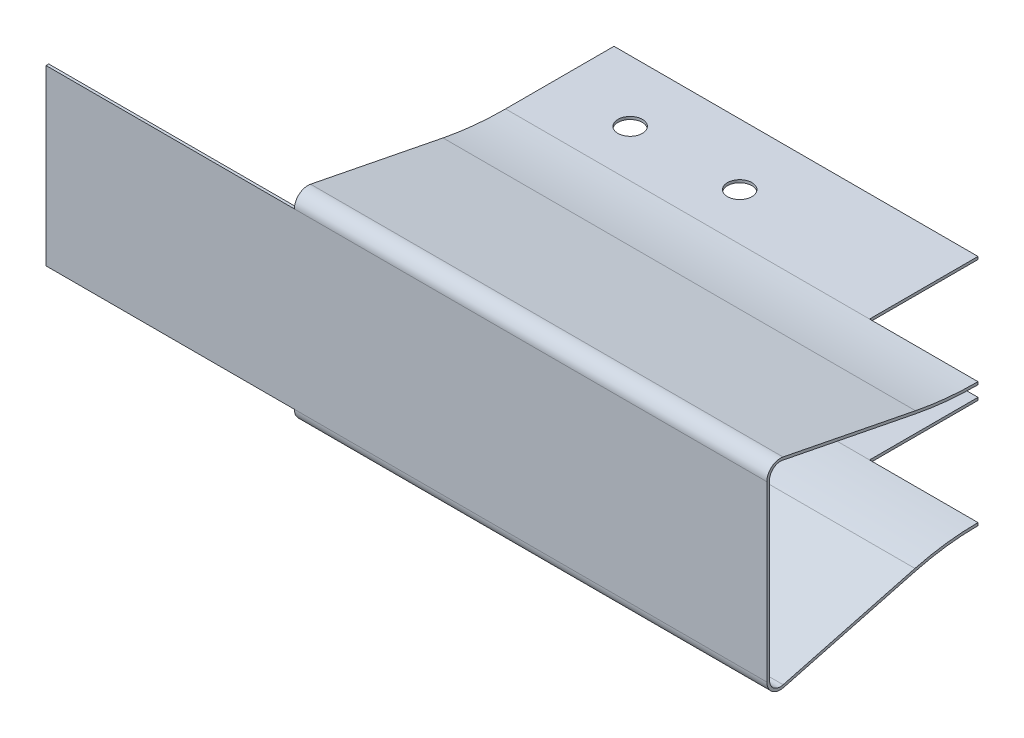
ISO-10303-21;
HEADER;
FILE_DESCRIPTION(('STEP AP214'),'2;1');
FILE_NAME('part.step','',(''),(''),'','','');
FILE_SCHEMA(('AUTOMOTIVE_DESIGN { 1 0 10303 214 1 1 1 1 }'));
ENDSEC;
DATA;
#1=APPLICATION_CONTEXT('core data for automotive mechanical design processes');
#2=APPLICATION_PROTOCOL_DEFINITION('international standard','automotive_design',2000,#1);
#3=PRODUCT_CONTEXT('',#1,'mechanical');
#4=PRODUCT('Part','Part','',(#3));
#5=PRODUCT_RELATED_PRODUCT_CATEGORY('part','',(#4));
#6=PRODUCT_DEFINITION_FORMATION('','',#4);
#7=PRODUCT_DEFINITION_CONTEXT('part definition',#1,'design');
#8=PRODUCT_DEFINITION('design','',#6,#7);
#9=PRODUCT_DEFINITION_SHAPE('','',#8);
#10=(LENGTH_UNIT() NAMED_UNIT(*) SI_UNIT(.MILLI.,.METRE.));
#11=(NAMED_UNIT(*) PLANE_ANGLE_UNIT() SI_UNIT($,.RADIAN.));
#12=(NAMED_UNIT(*) SI_UNIT($,.STERADIAN.) SOLID_ANGLE_UNIT());
#13=UNCERTAINTY_MEASURE_WITH_UNIT(LENGTH_MEASURE(1.E-05),#10,'distance_accuracy_value','');
#14=(GEOMETRIC_REPRESENTATION_CONTEXT(3) GLOBAL_UNCERTAINTY_ASSIGNED_CONTEXT((#13)) GLOBAL_UNIT_ASSIGNED_CONTEXT((#10,
#11,#12)) REPRESENTATION_CONTEXT('',''));
#15=CARTESIAN_POINT('',(0.,0.,0.));
#16=DIRECTION('',(0.,0.,1.));
#17=DIRECTION('',(1.,0.,0.));
#18=AXIS2_PLACEMENT_3D('',#15,#16,#17);
#19=CARTESIAN_POINT('',(66.46,6.56868151266737,10.8135610513));
#20=DIRECTION('',(0.,0.981043949577754,-0.193785368376667));
#21=DIRECTION('',(0.,0.193785368376667,0.981043949577755));
#22=AXIS2_PLACEMENT_3D('',#19,#20,#21);
#23=PLANE('',#22);
#24=DIRECTION('',(0.,0.193785368376667,0.981043949577755));
#25=VECTOR('',#24,1.);
#26=CARTESIAN_POINT('',(22.9,6.56868151266737,10.8135610513));
#27=LINE('',#26,#25);
#28=CARTESIAN_POINT('',(22.9,6.56868151266737,10.8135610513));
#29=VERTEX_POINT('',#28);
#30=CARTESIAN_POINT('',(22.9,8.98104394957776,23.0262146316233));
#31=VERTEX_POINT('',#30);
#32=EDGE_CURVE('E222',#29,#31,#27,.T.);
#33=ORIENTED_EDGE('',*,*,#32,.F.);
#34=DIRECTION('',(-1.,0.,0.));
#35=VECTOR('',#34,1.);
#36=CARTESIAN_POINT('',(66.46,6.56868151266737,10.8135610513));
#37=LINE('',#36,#35);
#38=CARTESIAN_POINT('',(66.46,6.56868151266737,10.8135610513));
#39=VERTEX_POINT('',#38);
#40=EDGE_CURVE('E315',#39,#29,#37,.T.);
#41=ORIENTED_EDGE('',*,*,#40,.F.);
#42=DIRECTION('',(0.,-0.193785368376667,-0.981043949577754));
#43=VECTOR('',#42,1.);
#44=CARTESIAN_POINT('',(66.46,6.56868151266737,10.8135610513));
#45=LINE('',#44,#43);
#46=CARTESIAN_POINT('',(66.46,8.98104394957776,23.0262146316233));
#47=VERTEX_POINT('',#46);
#48=EDGE_CURVE('E235',#47,#39,#45,.T.);
#49=ORIENTED_EDGE('',*,*,#48,.F.);
#50=DIRECTION('',(-1.,0.,0.));
#51=VECTOR('',#50,1.);
#52=CARTESIAN_POINT('',(66.46,8.98104394957776,23.0262146316233));
#53=LINE('',#52,#51);
#54=EDGE_CURVE('E318',#47,#31,#53,.T.);
#55=ORIENTED_EDGE('',*,*,#54,.T.);
#56=EDGE_LOOP('',(#33,#41,#49,#55));
#57=FACE_BOUND('',#56,.T.);
#58=ADVANCED_FACE('F36',(#57),#23,.F.);
#59=CARTESIAN_POINT('',(66.46,6.81394250006181,10.7651147092058));
#60=DIRECTION('',(0.,-0.981043949577754,0.193785368376668));
#61=DIRECTION('',(0.,-0.193785368376668,-0.981043949577754));
#62=AXIS2_PLACEMENT_3D('',#59,#60,#61);
#63=PLANE('',#62);
#64=DIRECTION('',(-1.,0.,0.));
#65=VECTOR('',#64,1.);
#66=CARTESIAN_POINT('',(66.46,6.81394250006181,10.7651147092058));
#67=LINE('',#66,#65);
#68=CARTESIAN_POINT('',(66.46,6.81394250006181,10.7651147092058));
#69=VERTEX_POINT('',#68);
#70=CARTESIAN_POINT('',(22.9,6.8139425000618,10.7651147092058));
#71=VERTEX_POINT('',#70);
#72=EDGE_CURVE('E301',#69,#71,#67,.T.);
#73=ORIENTED_EDGE('',*,*,#72,.T.);
#74=DIRECTION('',(0.,-0.193785368376668,-0.981043949577754));
#75=VECTOR('',#74,1.);
#76=CARTESIAN_POINT('',(22.9,6.8139425000618,10.7651147092058));
#77=LINE('',#76,#75);
#78=CARTESIAN_POINT('',(22.9,9.22630493697219,22.9777682895292));
#79=VERTEX_POINT('',#78);
#80=EDGE_CURVE('E392',#79,#71,#77,.T.);
#81=ORIENTED_EDGE('',*,*,#80,.F.);
#82=DIRECTION('',(-1.,0.,0.));
#83=VECTOR('',#82,1.);
#84=CARTESIAN_POINT('',(66.46,9.22630493697219,22.9777682895292));
#85=LINE('',#84,#83);
#86=CARTESIAN_POINT('',(66.46,9.22630493697219,22.9777682895292));
#87=VERTEX_POINT('',#86);
#88=EDGE_CURVE('E298',#87,#79,#85,.T.);
#89=ORIENTED_EDGE('',*,*,#88,.F.);
#90=DIRECTION('',(0.,0.193785368376668,0.981043949577754));
#91=VECTOR('',#90,1.);
#92=CARTESIAN_POINT('',(66.46,6.81394250006181,10.7651147092058));
#93=LINE('',#92,#91);
#94=EDGE_CURVE('E242',#69,#87,#93,.T.);
#95=ORIENTED_EDGE('',*,*,#94,.F.);
#96=EDGE_LOOP('',(#73,#81,#89,#95));
#97=FACE_BOUND('',#96,.T.);
#98=ADVANCED_FACE('F419',(#97),#63,.F.);
#99=CARTESIAN_POINT('',(66.46,-5.99699897703984,10.7496792707317));
#100=DIRECTION('',(0.,0.966801887556448,0.255527122273329));
#101=DIRECTION('',(0.,-0.25552712227333,0.966801887556448));
#102=AXIS2_PLACEMENT_3D('',#99,#100,#101);
#103=PLANE('',#102);
#104=DIRECTION('',(0.,-0.25552712227333,0.966801887556448));
#105=VECTOR('',#104,1.);
#106=CARTESIAN_POINT('',(22.9,-5.99699897703984,10.7496792707317));
#107=LINE('',#106,#105);
#108=CARTESIAN_POINT('',(22.9,-5.99699897703984,10.7496792707317));
#109=VERTEX_POINT('',#108);
#110=CARTESIAN_POINT('',(22.9,-9.20850235944556,22.9005910971583));
#111=VERTEX_POINT('',#110);
#112=EDGE_CURVE('E227',#109,#111,#107,.T.);
#113=ORIENTED_EDGE('',*,*,#112,.F.);
#114=DIRECTION('',(-1.,0.,0.));
#115=VECTOR('',#114,1.);
#116=CARTESIAN_POINT('',(66.46,-5.99699897703983,10.7496792707317));
#117=LINE('',#116,#115);
#118=CARTESIAN_POINT('',(66.46,-5.99699897703983,10.7496792707317));
#119=VERTEX_POINT('',#118);
#120=EDGE_CURVE('E288',#119,#109,#117,.T.);
#121=ORIENTED_EDGE('',*,*,#120,.F.);
#122=DIRECTION('',(0.,0.255527122273329,-0.966801887556448));
#123=VECTOR('',#122,1.);
#124=CARTESIAN_POINT('',(66.46,-5.99699897703984,10.7496792707317));
#125=LINE('',#124,#123);
#126=CARTESIAN_POINT('',(66.46,-9.20850235944556,22.9005910971583));
#127=VERTEX_POINT('',#126);
#128=EDGE_CURVE('E250',#127,#119,#125,.T.);
#129=ORIENTED_EDGE('',*,*,#128,.F.);
#130=DIRECTION('',(-1.,0.,0.));
#131=VECTOR('',#130,1.);
#132=CARTESIAN_POINT('',(66.46,-9.20850235944556,22.9005910971583));
#133=LINE('',#132,#131);
#134=EDGE_CURVE('E291',#127,#111,#133,.T.);
#135=ORIENTED_EDGE('',*,*,#134,.T.);
#136=EDGE_LOOP('',(#113,#121,#129,#135));
#137=FACE_BOUND('',#136,.T.);
#138=ADVANCED_FACE('F491',(#137),#103,.F.);
#139=CARTESIAN_POINT('',(66.46,-5.75529850515072,10.8135610513));
#140=DIRECTION('',(0.,-0.966801887556448,-0.255527122273329));
#141=DIRECTION('',(0.,0.25552712227333,-0.966801887556448));
#142=AXIS2_PLACEMENT_3D('',#139,#140,#141);
#143=PLANE('',#142);
#144=DIRECTION('',(-1.,0.,0.));
#145=VECTOR('',#144,1.);
#146=CARTESIAN_POINT('',(66.46,-5.75529850515072,10.8135610513));
#147=LINE('',#146,#145);
#148=CARTESIAN_POINT('',(66.46,-5.75529850515072,10.8135610513));
#149=VERTEX_POINT('',#148);
#150=CARTESIAN_POINT('',(22.9,-5.75529850515072,10.8135610513));
#151=VERTEX_POINT('',#150);
#152=EDGE_CURVE('E274',#149,#151,#147,.T.);
#153=ORIENTED_EDGE('',*,*,#152,.T.);
#154=DIRECTION('',(0.,0.25552712227333,-0.966801887556448));
#155=VECTOR('',#154,1.);
#156=CARTESIAN_POINT('',(22.9,-5.75529850515072,10.8135610513));
#157=LINE('',#156,#155);
#158=CARTESIAN_POINT('',(22.9,-8.96680188755645,22.9644728777267));
#159=VERTEX_POINT('',#158);
#160=EDGE_CURVE('E220',#159,#151,#157,.T.);
#161=ORIENTED_EDGE('',*,*,#160,.F.);
#162=DIRECTION('',(-1.,0.,0.));
#163=VECTOR('',#162,1.);
#164=CARTESIAN_POINT('',(66.46,-8.96680188755645,22.9644728777267));
#165=LINE('',#164,#163);
#166=CARTESIAN_POINT('',(66.46,-8.96680188755645,22.9644728777267));
#167=VERTEX_POINT('',#166);
#168=EDGE_CURVE('E271',#167,#159,#165,.T.);
#169=ORIENTED_EDGE('',*,*,#168,.F.);
#170=DIRECTION('',(0.,-0.25552712227333,0.966801887556448));
#171=VECTOR('',#170,1.);
#172=CARTESIAN_POINT('',(66.46,-5.75529850515072,10.8135610513));
#173=LINE('',#172,#171);
#174=EDGE_CURVE('E257',#149,#167,#173,.T.);
#175=ORIENTED_EDGE('',*,*,#174,.F.);
#176=EDGE_LOOP('',(#153,#161,#169,#175));
#177=FACE_BOUND('',#176,.T.);
#178=ADVANCED_FACE('F514',(#177),#143,.F.);
#179=CARTESIAN_POINT('',(66.46,36.,5.));
#180=DIRECTION('',(-1.,0.,0.));
#181=DIRECTION('',(0.,0.,1.));
#182=AXIS2_PLACEMENT_3D('',#179,#180,#181);
#183=CYLINDRICAL_SURFACE('',#182,30.);
#184=ORIENTED_EDGE('',*,*,#40,.T.);
#185=CARTESIAN_POINT('',(22.9,36.,5.));
#186=DIRECTION('',(1.,0.,0.));
#187=DIRECTION('',(0.,0.,-1.));
#188=AXIS2_PLACEMENT_3D('',#185,#186,#187);
#189=CIRCLE('',#188,30.);
#190=CARTESIAN_POINT('',(22.9,6.,5.));
#191=VERTEX_POINT('',#190);
#192=EDGE_CURVE('E353',#29,#191,#189,.T.);
#193=ORIENTED_EDGE('',*,*,#192,.T.);
#194=DIRECTION('',(-1.,0.,0.));
#195=VECTOR('',#194,1.);
#196=CARTESIAN_POINT('',(66.46,6.,5.));
#197=LINE('',#196,#195);
#198=CARTESIAN_POINT('',(56.46,6.,4.99999999999999));
#199=VERTEX_POINT('',#198);
#200=EDGE_CURVE('E312',#199,#191,#197,.T.);
#201=ORIENTED_EDGE('',*,*,#200,.F.);
#202=CARTESIAN_POINT('',(66.46,6.,4.99999999999999));
#203=VERTEX_POINT('',#202);
#204=EDGE_CURVE('E313',#203,#199,#197,.T.);
#205=ORIENTED_EDGE('',*,*,#204,.F.);
#206=CARTESIAN_POINT('',(66.46,36.,5.));
#207=DIRECTION('',(1.,0.,0.));
#208=DIRECTION('',(0.,0.,1.));
#209=AXIS2_PLACEMENT_3D('',#206,#207,#208);
#210=CIRCLE('',#209,30.);
#211=EDGE_CURVE('E237',#39,#203,#210,.T.);
#212=ORIENTED_EDGE('',*,*,#211,.F.);
#213=EDGE_LOOP('',(#184,#193,#201,#205,#212));
#214=FACE_BOUND('',#213,.T.);
#215=ADVANCED_FACE('F350',(#214),#183,.T.);
#216=CARTESIAN_POINT('',(66.46,6.,5.));
#217=DIRECTION('',(0.,1.,0.));
#218=DIRECTION('',(0.,0.,1.));
#219=AXIS2_PLACEMENT_3D('',#216,#217,#218);
#220=PLANE('',#219);
#221=CARTESIAN_POINT('',(40.14,6.,0.649999999999996));
#222=DIRECTION('',(0.,1.,0.));
#223=DIRECTION('',(0.,0.,1.));
#224=AXIS2_PLACEMENT_3D('',#221,#222,#223);
#225=CIRCLE('',#224,1.125);
#226=CARTESIAN_POINT('',(40.14,6.,1.77499999999999));
#227=VERTEX_POINT('',#226);
#228=EDGE_CURVE('E330',#227,#227,#225,.T.);
#229=ORIENTED_EDGE('',*,*,#228,.T.);
#230=EDGE_LOOP('',(#229));
#231=FACE_BOUND('',#230,.T.);
#232=CARTESIAN_POINT('',(30.04,6.,0.649999999999996));
#233=DIRECTION('',(0.,1.,0.));
#234=DIRECTION('',(0.,0.,1.));
#235=AXIS2_PLACEMENT_3D('',#232,#233,#234);
#236=CIRCLE('',#235,1.125);
#237=CARTESIAN_POINT('',(30.04,6.,1.77499999999999));
#238=VERTEX_POINT('',#237);
#239=EDGE_CURVE('E432',#238,#238,#236,.T.);
#240=ORIENTED_EDGE('',*,*,#239,.T.);
#241=EDGE_LOOP('',(#240));
#242=FACE_BOUND('',#241,.T.);
#243=DIRECTION('',(-1.,0.,0.));
#244=VECTOR('',#243,1.);
#245=CARTESIAN_POINT('',(66.46,6.,-5.));
#246=LINE('',#245,#244);
#247=CARTESIAN_POINT('',(56.46,6.,-4.99999999999999));
#248=VERTEX_POINT('',#247);
#249=CARTESIAN_POINT('',(22.9,6.,-5.));
#250=VERTEX_POINT('',#249);
#251=EDGE_CURVE('E310',#248,#250,#246,.T.);
#252=ORIENTED_EDGE('',*,*,#251,.F.);
#253=DIRECTION('',(0.,0.,1.));
#254=VECTOR('',#253,1.);
#255=CARTESIAN_POINT('',(56.46,6.,5.));
#256=LINE('',#255,#254);
#257=EDGE_CURVE('E334',#248,#199,#256,.T.);
#258=ORIENTED_EDGE('',*,*,#257,.T.);
#259=ORIENTED_EDGE('',*,*,#200,.T.);
#260=DIRECTION('',(0.,0.,-1.));
#261=VECTOR('',#260,1.);
#262=CARTESIAN_POINT('',(22.9,6.,5.));
#263=LINE('',#262,#261);
#264=EDGE_CURVE('E360',#191,#250,#263,.T.);
#265=ORIENTED_EDGE('',*,*,#264,.T.);
#266=EDGE_LOOP('',(#252,#258,#259,#265));
#267=FACE_BOUND('',#266,.T.);
#268=ADVANCED_FACE('F359',(#231,#242,#267),#220,.F.);
#269=CARTESIAN_POINT('',(66.46,6.25,-5.));
#270=DIRECTION('',(0.,0.,1.));
#271=DIRECTION('',(1.,0.,0.));
#272=AXIS2_PLACEMENT_3D('',#269,#270,#271);
#273=PLANE('',#272);
#274=DIRECTION('',(-1.,0.,0.));
#275=VECTOR('',#274,1.);
#276=CARTESIAN_POINT('',(66.46,6.25,-5.));
#277=LINE('',#276,#275);
#278=CARTESIAN_POINT('',(56.46,6.25,-4.99999999999999));
#279=VERTEX_POINT('',#278);
#280=CARTESIAN_POINT('',(22.9,6.25,-5.));
#281=VERTEX_POINT('',#280);
#282=EDGE_CURVE('E308',#279,#281,#277,.T.);
#283=ORIENTED_EDGE('',*,*,#282,.F.);
#284=DIRECTION('',(0.,1.,0.));
#285=VECTOR('',#284,1.);
#286=CARTESIAN_POINT('',(56.46,-9.25,-4.99999999999999));
#287=LINE('',#286,#285);
#288=EDGE_CURVE('E202',#248,#279,#287,.T.);
#289=ORIENTED_EDGE('',*,*,#288,.F.);
#290=ORIENTED_EDGE('',*,*,#251,.T.);
#291=DIRECTION('',(0.,1.,0.));
#292=VECTOR('',#291,1.);
#293=CARTESIAN_POINT('',(22.9,-9.25,-5.));
#294=LINE('',#293,#292);
#295=EDGE_CURVE('E366',#250,#281,#294,.T.);
#296=ORIENTED_EDGE('',*,*,#295,.T.);
#297=EDGE_LOOP('',(#283,#289,#290,#296));
#298=FACE_BOUND('',#297,.T.);
#299=ADVANCED_FACE('F430',(#298),#273,.F.);
#300=CARTESIAN_POINT('',(66.46,6.25,5.));
#301=DIRECTION('',(0.,-1.,0.));
#302=DIRECTION('',(0.,0.,-1.));
#303=AXIS2_PLACEMENT_3D('',#300,#301,#302);
#304=PLANE('',#303);
#305=CARTESIAN_POINT('',(40.14,6.25,0.649999999999996));
#306=DIRECTION('',(0.,-1.,0.));
#307=DIRECTION('',(0.,0.,-1.));
#308=AXIS2_PLACEMENT_3D('',#305,#306,#307);
#309=CIRCLE('',#308,1.125);
#310=CARTESIAN_POINT('',(40.14,6.25,-0.475000000000001));
#311=VERTEX_POINT('',#310);
#312=EDGE_CURVE('E444',#311,#311,#309,.T.);
#313=ORIENTED_EDGE('',*,*,#312,.T.);
#314=EDGE_LOOP('',(#313));
#315=FACE_BOUND('',#314,.T.);
#316=CARTESIAN_POINT('',(30.04,6.25,0.649999999999996));
#317=DIRECTION('',(0.,-1.,0.));
#318=DIRECTION('',(0.,0.,-1.));
#319=AXIS2_PLACEMENT_3D('',#316,#317,#318);
#320=CIRCLE('',#319,1.125);
#321=CARTESIAN_POINT('',(30.04,6.25,-0.475000000000001));
#322=VERTEX_POINT('',#321);
#323=EDGE_CURVE('E435',#322,#322,#320,.T.);
#324=ORIENTED_EDGE('',*,*,#323,.T.);
#325=EDGE_LOOP('',(#324));
#326=FACE_BOUND('',#325,.T.);
#327=DIRECTION('',(-1.,0.,0.));
#328=VECTOR('',#327,1.);
#329=CARTESIAN_POINT('',(66.46,6.25,4.99999999999999));
#330=LINE('',#329,#328);
#331=CARTESIAN_POINT('',(56.46,6.25,4.99999999999999));
#332=VERTEX_POINT('',#331);
#333=CARTESIAN_POINT('',(22.9,6.25,4.99999999999999));
#334=VERTEX_POINT('',#333);
#335=EDGE_CURVE('E304',#332,#334,#330,.T.);
#336=ORIENTED_EDGE('',*,*,#335,.F.);
#337=DIRECTION('',(0.,0.,-1.));
#338=VECTOR('',#337,1.);
#339=CARTESIAN_POINT('',(56.46,6.25,5.));
#340=LINE('',#339,#338);
#341=EDGE_CURVE('E427',#332,#279,#340,.T.);
#342=ORIENTED_EDGE('',*,*,#341,.T.);
#343=ORIENTED_EDGE('',*,*,#282,.T.);
#344=DIRECTION('',(0.,0.,1.));
#345=VECTOR('',#344,1.);
#346=CARTESIAN_POINT('',(22.9,6.25,5.));
#347=LINE('',#346,#345);
#348=EDGE_CURVE('E387',#281,#334,#347,.T.);
#349=ORIENTED_EDGE('',*,*,#348,.T.);
#350=EDGE_LOOP('',(#336,#342,#343,#349));
#351=FACE_BOUND('',#350,.T.);
#352=ADVANCED_FACE('F426',(#315,#326,#351),#304,.F.);
#353=CARTESIAN_POINT('',(66.46,36.,5.));
#354=DIRECTION('',(-1.,0.,0.));
#355=DIRECTION('',(0.,0.,1.));
#356=AXIS2_PLACEMENT_3D('',#353,#354,#355);
#357=CYLINDRICAL_SURFACE('',#356,29.75);
#358=CARTESIAN_POINT('',(66.46,6.25,4.99999999999999));
#359=VERTEX_POINT('',#358);
#360=EDGE_CURVE('E305',#359,#332,#330,.T.);
#361=ORIENTED_EDGE('',*,*,#360,.T.);
#362=ORIENTED_EDGE('',*,*,#335,.T.);
#363=CARTESIAN_POINT('',(22.9,36.,5.));
#364=DIRECTION('',(1.,0.,0.));
#365=DIRECTION('',(0.,0.,-1.));
#366=AXIS2_PLACEMENT_3D('',#363,#364,#365);
#367=CIRCLE('',#366,29.75);
#368=EDGE_CURVE('E384',#334,#71,#367,.F.);
#369=ORIENTED_EDGE('',*,*,#368,.T.);
#370=ORIENTED_EDGE('',*,*,#72,.F.);
#371=CARTESIAN_POINT('',(66.46,36.,5.));
#372=DIRECTION('',(-1.,0.,0.));
#373=DIRECTION('',(0.,0.,1.));
#374=AXIS2_PLACEMENT_3D('',#371,#372,#373);
#375=CIRCLE('',#374,29.75);
#376=EDGE_CURVE('E240',#359,#69,#375,.T.);
#377=ORIENTED_EDGE('',*,*,#376,.F.);
#378=EDGE_LOOP('',(#361,#362,#369,#370,#377));
#379=FACE_BOUND('',#378,.T.);
#380=ADVANCED_FACE('F422',(#379),#357,.F.);
#381=CARTESIAN_POINT('',(66.46,-27.7512484764001,5.));
#382=DIRECTION('',(-1.,0.,0.));
#383=DIRECTION('',(0.,0.,1.));
#384=AXIS2_PLACEMENT_3D('',#381,#382,#383);
#385=CYLINDRICAL_SURFACE('',#384,22.5012484764001);
#386=ORIENTED_EDGE('',*,*,#120,.T.);
#387=CARTESIAN_POINT('',(22.9,-27.7512484764001,5.));
#388=DIRECTION('',(1.,0.,0.));
#389=DIRECTION('',(0.,0.,-1.));
#390=AXIS2_PLACEMENT_3D('',#387,#388,#389);
#391=CIRCLE('',#390,22.5012484764001);
#392=CARTESIAN_POINT('',(22.9,-5.25,5.));
#393=VERTEX_POINT('',#392);
#394=EDGE_CURVE('E367',#109,#393,#391,.F.);
#395=ORIENTED_EDGE('',*,*,#394,.T.);
#396=DIRECTION('',(-1.,0.,0.));
#397=VECTOR('',#396,1.);
#398=CARTESIAN_POINT('',(66.46,-5.25,5.));
#399=LINE('',#398,#397);
#400=CARTESIAN_POINT('',(56.46,-5.25,4.99999999999999));
#401=VERTEX_POINT('',#400);
#402=EDGE_CURVE('E285',#401,#393,#399,.T.);
#403=ORIENTED_EDGE('',*,*,#402,.F.);
#404=CARTESIAN_POINT('',(66.46,-5.25,4.99999999999999));
#405=VERTEX_POINT('',#404);
#406=EDGE_CURVE('E286',#405,#401,#399,.T.);
#407=ORIENTED_EDGE('',*,*,#406,.F.);
#408=CARTESIAN_POINT('',(66.46,-27.7512484764001,5.));
#409=DIRECTION('',(-1.,0.,0.));
#410=DIRECTION('',(0.,0.,-1.));
#411=AXIS2_PLACEMENT_3D('',#408,#409,#410);
#412=CIRCLE('',#411,22.5012484764001);
#413=EDGE_CURVE('E252',#119,#405,#412,.T.);
#414=ORIENTED_EDGE('',*,*,#413,.F.);
#415=EDGE_LOOP('',(#386,#395,#403,#407,#414));
#416=FACE_BOUND('',#415,.T.);
#417=ADVANCED_FACE('F486',(#416),#385,.F.);
#418=CARTESIAN_POINT('',(66.46,-5.25,5.));
#419=DIRECTION('',(0.,1.,0.));
#420=DIRECTION('',(0.,0.,1.));
#421=AXIS2_PLACEMENT_3D('',#418,#419,#420);
#422=PLANE('',#421);
#423=CARTESIAN_POINT('',(40.14,-5.25,0.649999999999996));
#424=DIRECTION('',(0.,1.,0.));
#425=DIRECTION('',(0.,0.,1.));
#426=AXIS2_PLACEMENT_3D('',#423,#424,#425);
#427=CIRCLE('',#426,1.125);
#428=CARTESIAN_POINT('',(40.14,-5.25,1.77499999999999));
#429=VERTEX_POINT('',#428);
#430=EDGE_CURVE('E333',#429,#429,#427,.T.);
#431=ORIENTED_EDGE('',*,*,#430,.T.);
#432=EDGE_LOOP('',(#431));
#433=FACE_BOUND('',#432,.T.);
#434=CARTESIAN_POINT('',(30.04,-5.25,0.649999999999996));
#435=DIRECTION('',(0.,1.,0.));
#436=DIRECTION('',(0.,0.,1.));
#437=AXIS2_PLACEMENT_3D('',#434,#435,#436);
#438=CIRCLE('',#437,1.125);
#439=CARTESIAN_POINT('',(30.04,-5.25,1.77499999999999));
#440=VERTEX_POINT('',#439);
#441=EDGE_CURVE('E329',#440,#440,#438,.T.);
#442=ORIENTED_EDGE('',*,*,#441,.T.);
#443=EDGE_LOOP('',(#442));
#444=FACE_BOUND('',#443,.T.);
#445=DIRECTION('',(-1.,0.,0.));
#446=VECTOR('',#445,1.);
#447=CARTESIAN_POINT('',(66.46,-5.25,-5.));
#448=LINE('',#447,#446);
#449=CARTESIAN_POINT('',(56.46,-5.25,-4.99999999999999));
#450=VERTEX_POINT('',#449);
#451=CARTESIAN_POINT('',(22.9,-5.25,-5.));
#452=VERTEX_POINT('',#451);
#453=EDGE_CURVE('E283',#450,#452,#448,.T.);
#454=ORIENTED_EDGE('',*,*,#453,.F.);
#455=DIRECTION('',(0.,0.,1.));
#456=VECTOR('',#455,1.);
#457=CARTESIAN_POINT('',(56.46,-5.25,5.));
#458=LINE('',#457,#456);
#459=EDGE_CURVE('E451',#450,#401,#458,.T.);
#460=ORIENTED_EDGE('',*,*,#459,.T.);
#461=ORIENTED_EDGE('',*,*,#402,.T.);
#462=DIRECTION('',(0.,0.,-1.));
#463=VECTOR('',#462,1.);
#464=CARTESIAN_POINT('',(22.9,-5.25,5.));
#465=LINE('',#464,#463);
#466=EDGE_CURVE('E370',#393,#452,#465,.T.);
#467=ORIENTED_EDGE('',*,*,#466,.T.);
#468=EDGE_LOOP('',(#454,#460,#461,#467));
#469=FACE_BOUND('',#468,.T.);
#470=ADVANCED_FACE('F482',(#433,#444,#469),#422,.F.);
#471=CARTESIAN_POINT('',(66.46,-5.,-5.));
#472=DIRECTION('',(0.,0.,1.));
#473=DIRECTION('',(1.,0.,0.));
#474=AXIS2_PLACEMENT_3D('',#471,#472,#473);
#475=PLANE('',#474);
#476=DIRECTION('',(-1.,0.,0.));
#477=VECTOR('',#476,1.);
#478=CARTESIAN_POINT('',(66.46,-5.,-5.));
#479=LINE('',#478,#477);
#480=CARTESIAN_POINT('',(56.46,-5.,-4.99999999999999));
#481=VERTEX_POINT('',#480);
#482=CARTESIAN_POINT('',(22.9,-5.,-5.));
#483=VERTEX_POINT('',#482);
#484=EDGE_CURVE('E281',#481,#483,#479,.T.);
#485=ORIENTED_EDGE('',*,*,#484,.F.);
#486=EDGE_CURVE('E459',#450,#481,#287,.T.);
#487=ORIENTED_EDGE('',*,*,#486,.F.);
#488=ORIENTED_EDGE('',*,*,#453,.T.);
#489=EDGE_CURVE('E372',#452,#483,#294,.T.);
#490=ORIENTED_EDGE('',*,*,#489,.T.);
#491=EDGE_LOOP('',(#485,#487,#488,#490));
#492=FACE_BOUND('',#491,.T.);
#493=ADVANCED_FACE('F474',(#492),#475,.F.);
#494=CARTESIAN_POINT('',(66.46,-5.,5.));
#495=DIRECTION('',(0.,-1.,0.));
#496=DIRECTION('',(0.,0.,-1.));
#497=AXIS2_PLACEMENT_3D('',#494,#495,#496);
#498=PLANE('',#497);
#499=CARTESIAN_POINT('',(40.14,-5.,0.649999999999996));
#500=DIRECTION('',(0.,-1.,0.));
#501=DIRECTION('',(0.,0.,-1.));
#502=AXIS2_PLACEMENT_3D('',#499,#500,#501);
#503=CIRCLE('',#502,1.125);
#504=CARTESIAN_POINT('',(40.14,-5.,-0.475000000000001));
#505=VERTEX_POINT('',#504);
#506=EDGE_CURVE('E331',#505,#505,#503,.T.);
#507=ORIENTED_EDGE('',*,*,#506,.T.);
#508=EDGE_LOOP('',(#507));
#509=FACE_BOUND('',#508,.T.);
#510=CARTESIAN_POINT('',(30.04,-5.,0.649999999999996));
#511=DIRECTION('',(0.,-1.,0.));
#512=DIRECTION('',(0.,0.,-1.));
#513=AXIS2_PLACEMENT_3D('',#510,#511,#512);
#514=CIRCLE('',#513,1.125);
#515=CARTESIAN_POINT('',(30.04,-5.,-0.475000000000001));
#516=VERTEX_POINT('',#515);
#517=EDGE_CURVE('E326',#516,#516,#514,.T.);
#518=ORIENTED_EDGE('',*,*,#517,.T.);
#519=EDGE_LOOP('',(#518));
#520=FACE_BOUND('',#519,.T.);
#521=DIRECTION('',(-1.,0.,0.));
#522=VECTOR('',#521,1.);
#523=CARTESIAN_POINT('',(66.46,-5.,5.));
#524=LINE('',#523,#522);
#525=CARTESIAN_POINT('',(56.46,-5.,4.99999999999999));
#526=VERTEX_POINT('',#525);
#527=CARTESIAN_POINT('',(22.9,-5.,5.));
#528=VERTEX_POINT('',#527);
#529=EDGE_CURVE('E277',#526,#528,#524,.T.);
#530=ORIENTED_EDGE('',*,*,#529,.F.);
#531=DIRECTION('',(0.,0.,-1.));
#532=VECTOR('',#531,1.);
#533=CARTESIAN_POINT('',(56.46,-5.,5.));
#534=LINE('',#533,#532);
#535=EDGE_CURVE('E454',#526,#481,#534,.T.);
#536=ORIENTED_EDGE('',*,*,#535,.T.);
#537=ORIENTED_EDGE('',*,*,#484,.T.);
#538=DIRECTION('',(0.,0.,1.));
#539=VECTOR('',#538,1.);
#540=CARTESIAN_POINT('',(22.9,-5.,5.));
#541=LINE('',#540,#539);
#542=EDGE_CURVE('E381',#483,#528,#541,.T.);
#543=ORIENTED_EDGE('',*,*,#542,.T.);
#544=EDGE_LOOP('',(#530,#536,#537,#543));
#545=FACE_BOUND('',#544,.T.);
#546=ADVANCED_FACE('F472',(#509,#520,#545),#498,.F.);
#547=CARTESIAN_POINT('',(66.46,-27.7512484764001,5.));
#548=DIRECTION('',(-1.,0.,0.));
#549=DIRECTION('',(0.,0.,1.));
#550=AXIS2_PLACEMENT_3D('',#547,#548,#549);
#551=CYLINDRICAL_SURFACE('',#550,22.7512484764001);
#552=CARTESIAN_POINT('',(66.46,-5.,5.));
#553=VERTEX_POINT('',#552);
#554=EDGE_CURVE('E278',#553,#526,#524,.T.);
#555=ORIENTED_EDGE('',*,*,#554,.T.);
#556=ORIENTED_EDGE('',*,*,#529,.T.);
#557=CARTESIAN_POINT('',(22.9,-27.7512484764001,5.));
#558=DIRECTION('',(1.,0.,0.));
#559=DIRECTION('',(0.,0.,-1.));
#560=AXIS2_PLACEMENT_3D('',#557,#558,#559);
#561=CIRCLE('',#560,22.7512484764001);
#562=EDGE_CURVE('E378',#528,#151,#561,.T.);
#563=ORIENTED_EDGE('',*,*,#562,.T.);
#564=ORIENTED_EDGE('',*,*,#152,.F.);
#565=CARTESIAN_POINT('',(66.46,-27.7512484764001,5.));
#566=DIRECTION('',(1.,0.,0.));
#567=DIRECTION('',(0.,0.,-1.));
#568=AXIS2_PLACEMENT_3D('',#565,#566,#567);
#569=CIRCLE('',#568,22.7512484764001);
#570=EDGE_CURVE('E255',#553,#149,#569,.T.);
#571=ORIENTED_EDGE('',*,*,#570,.F.);
#572=EDGE_LOOP('',(#555,#556,#563,#564,#571));
#573=FACE_BOUND('',#572,.T.);
#574=ADVANCED_FACE('F538',(#573),#551,.T.);
#575=CARTESIAN_POINT('',(66.46,8.,23.22));
#576=DIRECTION('',(-1.,0.,0.));
#577=DIRECTION('',(0.,0.,1.));
#578=AXIS2_PLACEMENT_3D('',#575,#576,#577);
#579=CYLINDRICAL_SURFACE('',#578,1.);
#580=CARTESIAN_POINT('',(22.9,8.,23.22));
#581=DIRECTION('',(-1.,0.,0.));
#582=DIRECTION('',(0.,-1.,0.));
#583=AXIS2_PLACEMENT_3D('',#580,#581,#582);
#584=CIRCLE('',#583,1.);
#585=CARTESIAN_POINT('',(22.9,8.,24.22));
#586=VERTEX_POINT('',#585);
#587=EDGE_CURVE('E218',#31,#586,#584,.F.);
#588=ORIENTED_EDGE('',*,*,#587,.F.);
#589=ORIENTED_EDGE('',*,*,#54,.F.);
#590=CARTESIAN_POINT('',(66.46,8.,23.22));
#591=DIRECTION('',(-1.,0.,0.));
#592=DIRECTION('',(0.,0.,-1.));
#593=AXIS2_PLACEMENT_3D('',#590,#591,#592);
#594=CIRCLE('',#593,1.);
#595=CARTESIAN_POINT('',(66.46,8.,24.22));
#596=VERTEX_POINT('',#595);
#597=EDGE_CURVE('E232',#596,#47,#594,.T.);
#598=ORIENTED_EDGE('',*,*,#597,.F.);
#599=DIRECTION('',(-1.,0.,0.));
#600=VECTOR('',#599,1.);
#601=CARTESIAN_POINT('',(66.46,8.,24.22));
#602=LINE('',#601,#600);
#603=EDGE_CURVE('E264',#596,#586,#602,.T.);
#604=ORIENTED_EDGE('',*,*,#603,.T.);
#605=EDGE_LOOP('',(#588,#589,#598,#604));
#606=FACE_BOUND('',#605,.T.);
#607=ADVANCED_FACE('F38',(#606),#579,.F.);
#608=CARTESIAN_POINT('',(66.46,8.,23.22));
#609=DIRECTION('',(-1.,0.,0.));
#610=DIRECTION('',(0.,0.,1.));
#611=AXIS2_PLACEMENT_3D('',#608,#609,#610);
#612=CYLINDRICAL_SURFACE('',#611,1.25);
#613=CARTESIAN_POINT('',(22.9,8.,23.22));
#614=DIRECTION('',(-1.,0.,0.));
#615=DIRECTION('',(0.,-1.,0.));
#616=AXIS2_PLACEMENT_3D('',#613,#614,#615);
#617=CIRCLE('',#616,1.25);
#618=CARTESIAN_POINT('',(22.9,8.,24.47));
#619=VERTEX_POINT('',#618);
#620=EDGE_CURVE('E323',#619,#79,#617,.T.);
#621=ORIENTED_EDGE('',*,*,#620,.F.);
#622=DIRECTION('',(-1.,0.,0.));
#623=VECTOR('',#622,1.);
#624=CARTESIAN_POINT('',(66.46,8.,24.47));
#625=LINE('',#624,#623);
#626=CARTESIAN_POINT('',(66.46,8.,24.47));
#627=VERTEX_POINT('',#626);
#628=EDGE_CURVE('E296',#627,#619,#625,.T.);
#629=ORIENTED_EDGE('',*,*,#628,.F.);
#630=CARTESIAN_POINT('',(66.46,8.,23.22));
#631=DIRECTION('',(1.,0.,0.));
#632=DIRECTION('',(0.,0.,-1.));
#633=AXIS2_PLACEMENT_3D('',#630,#631,#632);
#634=CIRCLE('',#633,1.25);
#635=EDGE_CURVE('E244',#87,#627,#634,.T.);
#636=ORIENTED_EDGE('',*,*,#635,.F.);
#637=ORIENTED_EDGE('',*,*,#88,.T.);
#638=EDGE_LOOP('',(#621,#629,#636,#637));
#639=FACE_BOUND('',#638,.T.);
#640=ADVANCED_FACE('F409',(#639),#612,.T.);
#641=CARTESIAN_POINT('',(66.46,-8.,23.22));
#642=DIRECTION('',(-1.,0.,0.));
#643=DIRECTION('',(0.,0.,1.));
#644=AXIS2_PLACEMENT_3D('',#641,#642,#643);
#645=CYLINDRICAL_SURFACE('',#644,1.25);
#646=CARTESIAN_POINT('',(22.9,-8.,23.22));
#647=DIRECTION('',(-1.,0.,0.));
#648=DIRECTION('',(0.,0.,1.));
#649=AXIS2_PLACEMENT_3D('',#646,#647,#648);
#650=CIRCLE('',#649,1.25);
#651=CARTESIAN_POINT('',(22.9,-8.,24.47));
#652=VERTEX_POINT('',#651);
#653=EDGE_CURVE('E230',#111,#652,#650,.T.);
#654=ORIENTED_EDGE('',*,*,#653,.F.);
#655=ORIENTED_EDGE('',*,*,#134,.F.);
#656=CARTESIAN_POINT('',(66.46,-8.,23.22));
#657=DIRECTION('',(1.,0.,0.));
#658=DIRECTION('',(0.,0.,-1.));
#659=AXIS2_PLACEMENT_3D('',#656,#657,#658);
#660=CIRCLE('',#659,1.25);
#661=CARTESIAN_POINT('',(66.46,-8.,24.47));
#662=VERTEX_POINT('',#661);
#663=EDGE_CURVE('E248',#662,#127,#660,.T.);
#664=ORIENTED_EDGE('',*,*,#663,.F.);
#665=DIRECTION('',(-1.,0.,0.));
#666=VECTOR('',#665,1.);
#667=CARTESIAN_POINT('',(66.46,-8.,24.47));
#668=LINE('',#667,#666);
#669=EDGE_CURVE('E294',#662,#652,#668,.T.);
#670=ORIENTED_EDGE('',*,*,#669,.T.);
#671=EDGE_LOOP('',(#654,#655,#664,#670));
#672=FACE_BOUND('',#671,.T.);
#673=ADVANCED_FACE('F493',(#672),#645,.T.);
#674=CARTESIAN_POINT('',(66.46,-8.,23.22));
#675=DIRECTION('',(-1.,0.,0.));
#676=DIRECTION('',(0.,0.,1.));
#677=AXIS2_PLACEMENT_3D('',#674,#675,#676);
#678=CYLINDRICAL_SURFACE('',#677,1.);
#679=CARTESIAN_POINT('',(22.9,-8.,23.22));
#680=DIRECTION('',(-1.,0.,0.));
#681=DIRECTION('',(0.,0.,1.));
#682=AXIS2_PLACEMENT_3D('',#679,#680,#681);
#683=CIRCLE('',#682,1.);
#684=CARTESIAN_POINT('',(22.9,-8.,24.22));
#685=VERTEX_POINT('',#684);
#686=EDGE_CURVE('E321',#685,#159,#683,.F.);
#687=ORIENTED_EDGE('',*,*,#686,.F.);
#688=DIRECTION('',(-1.,0.,0.));
#689=VECTOR('',#688,1.);
#690=CARTESIAN_POINT('',(66.46,-8.,24.22));
#691=LINE('',#690,#689);
#692=CARTESIAN_POINT('',(66.46,-8.,24.22));
#693=VERTEX_POINT('',#692);
#694=EDGE_CURVE('E268',#693,#685,#691,.T.);
#695=ORIENTED_EDGE('',*,*,#694,.F.);
#696=CARTESIAN_POINT('',(66.46,-8.,23.22));
#697=DIRECTION('',(-1.,0.,0.));
#698=DIRECTION('',(0.,0.,-1.));
#699=AXIS2_PLACEMENT_3D('',#696,#697,#698);
#700=CIRCLE('',#699,1.);
#701=EDGE_CURVE('E259',#167,#693,#700,.T.);
#702=ORIENTED_EDGE('',*,*,#701,.F.);
#703=ORIENTED_EDGE('',*,*,#168,.T.);
#704=EDGE_LOOP('',(#687,#695,#702,#703));
#705=FACE_BOUND('',#704,.T.);
#706=ADVANCED_FACE('F495',(#705),#678,.F.);
#707=CARTESIAN_POINT('',(66.46,8.,24.47));
#708=DIRECTION('',(0.,0.,-1.));
#709=DIRECTION('',(-1.,0.,0.));
#710=AXIS2_PLACEMENT_3D('',#707,#708,#709);
#711=PLANE('',#710);
#712=DIRECTION('',(1.,0.,0.));
#713=VECTOR('',#712,1.);
#714=CARTESIAN_POINT('',(-22.9,8.,24.47));
#715=LINE('',#714,#713);
#716=CARTESIAN_POINT('',(0.,8.,24.47));
#717=VERTEX_POINT('',#716);
#718=EDGE_CURVE('E212',#717,#619,#715,.T.);
#719=ORIENTED_EDGE('',*,*,#718,.F.);
#720=DIRECTION('',(0.,1.,0.));
#721=VECTOR('',#720,1.);
#722=CARTESIAN_POINT('',(0.,-9.25,24.47));
#723=LINE('',#722,#721);
#724=CARTESIAN_POINT('',(0.,-8.,24.47));
#725=VERTEX_POINT('',#724);
#726=EDGE_CURVE('E50',#725,#717,#723,.T.);
#727=ORIENTED_EDGE('',*,*,#726,.F.);
#728=DIRECTION('',(-1.,0.,0.));
#729=VECTOR('',#728,1.);
#730=CARTESIAN_POINT('',(-22.9,-8.,24.47));
#731=LINE('',#730,#729);
#732=EDGE_CURVE('E209',#652,#725,#731,.T.);
#733=ORIENTED_EDGE('',*,*,#732,.F.);
#734=ORIENTED_EDGE('',*,*,#669,.F.);
#735=DIRECTION('',(0.,-1.,0.));
#736=VECTOR('',#735,1.);
#737=CARTESIAN_POINT('',(66.46,8.,24.47));
#738=LINE('',#737,#736);
#739=EDGE_CURVE('E246',#627,#662,#738,.T.);
#740=ORIENTED_EDGE('',*,*,#739,.F.);
#741=ORIENTED_EDGE('',*,*,#628,.T.);
#742=EDGE_LOOP('',(#719,#727,#733,#734,#740,#741));
#743=FACE_BOUND('',#742,.T.);
#744=ADVANCED_FACE('F207',(#743),#711,.F.);
#745=CARTESIAN_POINT('',(66.46,8.,24.22));
#746=DIRECTION('',(0.,0.,1.));
#747=DIRECTION('',(1.,0.,0.));
#748=AXIS2_PLACEMENT_3D('',#745,#746,#747);
#749=PLANE('',#748);
#750=CARTESIAN_POINT('',(0.,-8.,24.22));
#751=VERTEX_POINT('',#750);
#752=EDGE_CURVE('E267',#685,#751,#691,.T.);
#753=ORIENTED_EDGE('',*,*,#752,.T.);
#754=DIRECTION('',(0.,1.,0.));
#755=VECTOR('',#754,1.);
#756=CARTESIAN_POINT('',(0.,8.,24.22));
#757=LINE('',#756,#755);
#758=CARTESIAN_POINT('',(0.,8.,24.22));
#759=VERTEX_POINT('',#758);
#760=EDGE_CURVE('E198',#751,#759,#757,.T.);
#761=ORIENTED_EDGE('',*,*,#760,.T.);
#762=EDGE_CURVE('E263',#586,#759,#602,.T.);
#763=ORIENTED_EDGE('',*,*,#762,.F.);
#764=ORIENTED_EDGE('',*,*,#603,.F.);
#765=DIRECTION('',(0.,1.,0.));
#766=VECTOR('',#765,1.);
#767=CARTESIAN_POINT('',(66.46,8.,24.22));
#768=LINE('',#767,#766);
#769=EDGE_CURVE('E261',#693,#596,#768,.T.);
#770=ORIENTED_EDGE('',*,*,#769,.F.);
#771=ORIENTED_EDGE('',*,*,#694,.T.);
#772=EDGE_LOOP('',(#753,#761,#763,#764,#770,#771));
#773=FACE_BOUND('',#772,.T.);
#774=ADVANCED_FACE('F404',(#773),#749,.F.);
#775=CARTESIAN_POINT('',(66.46,8.,23.22));
#776=DIRECTION('',(1.,0.,0.));
#777=DIRECTION('',(0.,0.,-1.));
#778=AXIS2_PLACEMENT_3D('',#775,#776,#777);
#779=PLANE('',#778);
#780=DIRECTION('',(0.,-1.,0.));
#781=VECTOR('',#780,1.);
#782=CARTESIAN_POINT('',(66.46,8.,4.99999999999999));
#783=LINE('',#782,#781);
#784=EDGE_CURVE('E44',#359,#203,#783,.T.);
#785=ORIENTED_EDGE('',*,*,#784,.F.);
#786=ORIENTED_EDGE('',*,*,#376,.T.);
#787=ORIENTED_EDGE('',*,*,#94,.T.);
#788=ORIENTED_EDGE('',*,*,#635,.T.);
#789=ORIENTED_EDGE('',*,*,#739,.T.);
#790=ORIENTED_EDGE('',*,*,#663,.T.);
#791=ORIENTED_EDGE('',*,*,#128,.T.);
#792=ORIENTED_EDGE('',*,*,#413,.T.);
#793=EDGE_CURVE('E325',#553,#405,#783,.T.);
#794=ORIENTED_EDGE('',*,*,#793,.F.);
#795=ORIENTED_EDGE('',*,*,#570,.T.);
#796=ORIENTED_EDGE('',*,*,#174,.T.);
#797=ORIENTED_EDGE('',*,*,#701,.T.);
#798=ORIENTED_EDGE('',*,*,#769,.T.);
#799=ORIENTED_EDGE('',*,*,#597,.T.);
#800=ORIENTED_EDGE('',*,*,#48,.T.);
#801=ORIENTED_EDGE('',*,*,#211,.T.);
#802=EDGE_LOOP('',(#785,#786,#787,#788,#789,#790,#791,#792,#794,#795,#796,#797,#798,#799,#800,#801));
#803=FACE_BOUND('',#802,.T.);
#804=ADVANCED_FACE('F346',(#803),#779,.T.);
#805=CARTESIAN_POINT('',(22.9,-8.,24.47));
#806=DIRECTION('',(-1.,0.,0.));
#807=DIRECTION('',(0.,0.,1.));
#808=AXIS2_PLACEMENT_3D('',#805,#806,#807);
#809=PLANE('',#808);
#810=DIRECTION('',(0.,0.,-1.));
#811=VECTOR('',#810,1.);
#812=CARTESIAN_POINT('',(22.9,-8.,24.47));
#813=LINE('',#812,#811);
#814=EDGE_CURVE('E217',#652,#685,#813,.T.);
#815=ORIENTED_EDGE('',*,*,#814,.T.);
#816=ORIENTED_EDGE('',*,*,#686,.T.);
#817=ORIENTED_EDGE('',*,*,#160,.T.);
#818=ORIENTED_EDGE('',*,*,#562,.F.);
#819=ORIENTED_EDGE('',*,*,#542,.F.);
#820=ORIENTED_EDGE('',*,*,#489,.F.);
#821=ORIENTED_EDGE('',*,*,#466,.F.);
#822=ORIENTED_EDGE('',*,*,#394,.F.);
#823=ORIENTED_EDGE('',*,*,#112,.T.);
#824=ORIENTED_EDGE('',*,*,#653,.T.);
#825=EDGE_LOOP('',(#815,#816,#817,#818,#819,#820,#821,#822,#823,#824));
#826=FACE_BOUND('',#825,.T.);
#827=ADVANCED_FACE('F478',(#826),#809,.T.);
#828=CARTESIAN_POINT('',(-22.9,-8.,24.47));
#829=DIRECTION('',(0.,-1.,0.));
#830=DIRECTION('',(1.,0.,0.));
#831=AXIS2_PLACEMENT_3D('',#828,#829,#830);
#832=PLANE('',#831);
#833=DIRECTION('',(0.,0.,1.));
#834=VECTOR('',#833,1.);
#835=CARTESIAN_POINT('',(0.,-8.,24.47));
#836=LINE('',#835,#834);
#837=EDGE_CURVE('E195',#751,#725,#836,.T.);
#838=ORIENTED_EDGE('',*,*,#837,.F.);
#839=ORIENTED_EDGE('',*,*,#752,.F.);
#840=ORIENTED_EDGE('',*,*,#814,.F.);
#841=ORIENTED_EDGE('',*,*,#732,.T.);
#842=EDGE_LOOP('',(#838,#839,#840,#841));
#843=FACE_BOUND('',#842,.T.);
#844=ADVANCED_FACE('F215',(#843),#832,.T.);
#845=CARTESIAN_POINT('',(22.9,9.25000000000001,24.47));
#846=DIRECTION('',(-1.,0.,0.));
#847=DIRECTION('',(0.,-1.,0.));
#848=AXIS2_PLACEMENT_3D('',#845,#846,#847);
#849=PLANE('',#848);
#850=ORIENTED_EDGE('',*,*,#620,.T.);
#851=ORIENTED_EDGE('',*,*,#80,.T.);
#852=ORIENTED_EDGE('',*,*,#368,.F.);
#853=ORIENTED_EDGE('',*,*,#348,.F.);
#854=ORIENTED_EDGE('',*,*,#295,.F.);
#855=ORIENTED_EDGE('',*,*,#264,.F.);
#856=ORIENTED_EDGE('',*,*,#192,.F.);
#857=ORIENTED_EDGE('',*,*,#32,.T.);
#858=ORIENTED_EDGE('',*,*,#587,.T.);
#859=DIRECTION('',(0.,0.,-1.));
#860=VECTOR('',#859,1.);
#861=CARTESIAN_POINT('',(22.9,8.,24.47));
#862=LINE('',#861,#860);
#863=EDGE_CURVE('E58',#619,#586,#862,.T.);
#864=ORIENTED_EDGE('',*,*,#863,.F.);
#865=EDGE_LOOP('',(#850,#851,#852,#853,#854,#855,#856,#857,#858,#864));
#866=FACE_BOUND('',#865,.T.);
#867=ADVANCED_FACE('F363',(#866),#849,.T.);
#868=CARTESIAN_POINT('',(-22.9,8.,24.47));
#869=DIRECTION('',(0.,1.,0.));
#870=DIRECTION('',(0.,0.,1.));
#871=AXIS2_PLACEMENT_3D('',#868,#869,#870);
#872=PLANE('',#871);
#873=DIRECTION('',(0.,0.,-1.));
#874=VECTOR('',#873,1.);
#875=CARTESIAN_POINT('',(0.,8.,24.47));
#876=LINE('',#875,#874);
#877=EDGE_CURVE('E11',#717,#759,#876,.T.);
#878=ORIENTED_EDGE('',*,*,#877,.F.);
#879=ORIENTED_EDGE('',*,*,#718,.T.);
#880=ORIENTED_EDGE('',*,*,#863,.T.);
#881=ORIENTED_EDGE('',*,*,#762,.T.);
#882=EDGE_LOOP('',(#878,#879,#880,#881));
#883=FACE_BOUND('',#882,.T.);
#884=ADVANCED_FACE('F405',(#883),#872,.T.);
#885=CARTESIAN_POINT('',(30.04,-9.25,0.649999999999996));
#886=DIRECTION('',(0.,1.,0.));
#887=DIRECTION('',(0.,0.,1.));
#888=AXIS2_PLACEMENT_3D('',#885,#886,#887);
#889=CYLINDRICAL_SURFACE('',#888,1.125);
#890=ORIENTED_EDGE('',*,*,#517,.F.);
#891=EDGE_LOOP('',(#890));
#892=FACE_BOUND('',#891,.T.);
#893=ORIENTED_EDGE('',*,*,#441,.F.);
#894=EDGE_LOOP('',(#893));
#895=FACE_BOUND('',#894,.T.);
#896=ADVANCED_FACE('F646',(#892,#895),#889,.F.);
#897=ORIENTED_EDGE('',*,*,#323,.F.);
#898=EDGE_LOOP('',(#897));
#899=FACE_BOUND('',#898,.T.);
#900=ORIENTED_EDGE('',*,*,#239,.F.);
#901=EDGE_LOOP('',(#900));
#902=FACE_BOUND('',#901,.T.);
#903=ADVANCED_FACE('F654',(#899,#902),#889,.F.);
#904=CARTESIAN_POINT('',(40.14,-9.25,0.649999999999996));
#905=DIRECTION('',(0.,1.,0.));
#906=DIRECTION('',(0.,0.,1.));
#907=AXIS2_PLACEMENT_3D('',#904,#905,#906);
#908=CYLINDRICAL_SURFACE('',#907,1.125);
#909=ORIENTED_EDGE('',*,*,#506,.F.);
#910=EDGE_LOOP('',(#909));
#911=FACE_BOUND('',#910,.T.);
#912=ORIENTED_EDGE('',*,*,#430,.F.);
#913=EDGE_LOOP('',(#912));
#914=FACE_BOUND('',#913,.T.);
#915=ADVANCED_FACE('F661',(#911,#914),#908,.F.);
#916=ORIENTED_EDGE('',*,*,#312,.F.);
#917=EDGE_LOOP('',(#916));
#918=FACE_BOUND('',#917,.T.);
#919=ORIENTED_EDGE('',*,*,#228,.F.);
#920=EDGE_LOOP('',(#919));
#921=FACE_BOUND('',#920,.T.);
#922=ADVANCED_FACE('F668',(#918,#921),#908,.F.);
#923=CARTESIAN_POINT('',(66.46,-9.25,4.99999999999999));
#924=DIRECTION('',(0.,0.,1.));
#925=DIRECTION('',(1.,0.,0.));
#926=AXIS2_PLACEMENT_3D('',#923,#924,#925);
#927=PLANE('',#926);
#928=DIRECTION('',(0.,1.,0.));
#929=VECTOR('',#928,1.);
#930=CARTESIAN_POINT('',(56.46,-9.25,4.99999999999999));
#931=LINE('',#930,#929);
#932=EDGE_CURVE('E457',#401,#526,#931,.T.);
#933=ORIENTED_EDGE('',*,*,#932,.T.);
#934=ORIENTED_EDGE('',*,*,#554,.F.);
#935=ORIENTED_EDGE('',*,*,#793,.T.);
#936=ORIENTED_EDGE('',*,*,#406,.T.);
#937=EDGE_LOOP('',(#933,#934,#935,#936));
#938=FACE_BOUND('',#937,.T.);
#939=ADVANCED_FACE('F676',(#938),#927,.F.);
#940=CARTESIAN_POINT('',(56.46,-9.25,-4.99999999999999));
#941=DIRECTION('',(-1.,0.,0.));
#942=DIRECTION('',(0.,0.,1.));
#943=AXIS2_PLACEMENT_3D('',#940,#941,#942);
#944=PLANE('',#943);
#945=ORIENTED_EDGE('',*,*,#486,.T.);
#946=ORIENTED_EDGE('',*,*,#535,.F.);
#947=ORIENTED_EDGE('',*,*,#932,.F.);
#948=ORIENTED_EDGE('',*,*,#459,.F.);
#949=EDGE_LOOP('',(#945,#946,#947,#948));
#950=FACE_BOUND('',#949,.T.);
#951=ADVANCED_FACE('F465',(#950),#944,.F.);
#952=ORIENTED_EDGE('',*,*,#288,.T.);
#953=ORIENTED_EDGE('',*,*,#341,.F.);
#954=EDGE_CURVE('E460',#199,#332,#931,.T.);
#955=ORIENTED_EDGE('',*,*,#954,.F.);
#956=ORIENTED_EDGE('',*,*,#257,.F.);
#957=EDGE_LOOP('',(#952,#953,#955,#956));
#958=FACE_BOUND('',#957,.T.);
#959=ADVANCED_FACE('F689',(#958),#944,.F.);
#960=ORIENTED_EDGE('',*,*,#954,.T.);
#961=ORIENTED_EDGE('',*,*,#360,.F.);
#962=ORIENTED_EDGE('',*,*,#784,.T.);
#963=ORIENTED_EDGE('',*,*,#204,.T.);
#964=EDGE_LOOP('',(#960,#961,#962,#963));
#965=FACE_BOUND('',#964,.T.);
#966=ADVANCED_FACE('F340',(#965),#927,.F.);
#967=CARTESIAN_POINT('',(0.,-9.25,24.47));
#968=DIRECTION('',(1.,0.,0.));
#969=DIRECTION('',(0.,0.,-1.));
#970=AXIS2_PLACEMENT_3D('',#967,#968,#969);
#971=PLANE('',#970);
#972=ORIENTED_EDGE('',*,*,#837,.T.);
#973=ORIENTED_EDGE('',*,*,#726,.T.);
#974=ORIENTED_EDGE('',*,*,#877,.T.);
#975=ORIENTED_EDGE('',*,*,#760,.F.);
#976=EDGE_LOOP('',(#972,#973,#974,#975));
#977=FACE_BOUND('',#976,.T.);
#978=ADVANCED_FACE('F196',(#977),#971,.F.);
#979=CLOSED_SHELL('',(#58,#98,#138,#178,#215,#268,#299,#352,#380,#417,#470,#493,#546,#574,#607,
#640,#673,#706,#744,#774,#804,#827,#844,#867,#884,#896,#903,#915,#922,#939,#951,#959,#966,#978));
#980=MANIFOLD_SOLID_BREP('B2',#979);
#981=ADVANCED_BREP_SHAPE_REPRESENTATION('',(#18,#980),#14);
#982=SHAPE_DEFINITION_REPRESENTATION(#9,#981);
ENDSEC;
END-ISO-10303-21;
